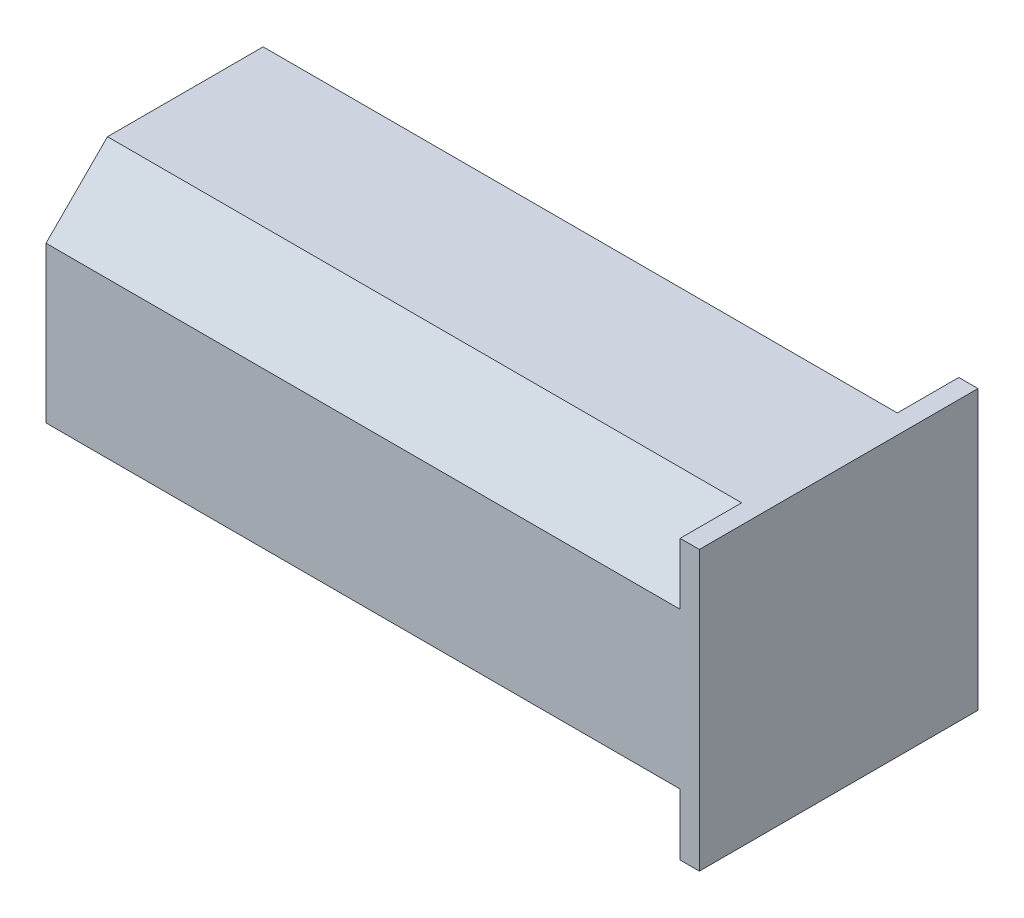
ISO-10303-21;
HEADER;
FILE_DESCRIPTION(('STEP AP214'),'2;1');
FILE_NAME('part.step','',(''),(''),'','','');
FILE_SCHEMA(('AUTOMOTIVE_DESIGN { 1 0 10303 214 1 1 1 1 }'));
ENDSEC;
DATA;
#1=APPLICATION_CONTEXT('core data for automotive mechanical design processes');
#2=APPLICATION_PROTOCOL_DEFINITION('international standard','automotive_design',2000,#1);
#3=PRODUCT_CONTEXT('',#1,'mechanical');
#4=PRODUCT('Part','Part','',(#3));
#5=PRODUCT_RELATED_PRODUCT_CATEGORY('part','',(#4));
#6=PRODUCT_DEFINITION_FORMATION('','',#4);
#7=PRODUCT_DEFINITION_CONTEXT('part definition',#1,'design');
#8=PRODUCT_DEFINITION('design','',#6,#7);
#9=PRODUCT_DEFINITION_SHAPE('','',#8);
#10=(LENGTH_UNIT() NAMED_UNIT(*) SI_UNIT(.MILLI.,.METRE.));
#11=(NAMED_UNIT(*) PLANE_ANGLE_UNIT() SI_UNIT($,.RADIAN.));
#12=(NAMED_UNIT(*) SI_UNIT($,.STERADIAN.) SOLID_ANGLE_UNIT());
#13=UNCERTAINTY_MEASURE_WITH_UNIT(LENGTH_MEASURE(1.E-05),#10,'distance_accuracy_value','');
#14=(GEOMETRIC_REPRESENTATION_CONTEXT(3) GLOBAL_UNCERTAINTY_ASSIGNED_CONTEXT((#13)) GLOBAL_UNIT_ASSIGNED_CONTEXT((#10,
#11,#12)) REPRESENTATION_CONTEXT('',''));
#15=CARTESIAN_POINT('',(0.,0.,0.));
#16=DIRECTION('',(0.,0.,1.));
#17=DIRECTION('',(1.,0.,0.));
#18=AXIS2_PLACEMENT_3D('',#15,#16,#17);
#19=CARTESIAN_POINT('',(95.500000000003,-2.9951961753816E-12,1356.24860364586));
#20=DIRECTION('',(0.,0.,1.));
#21=DIRECTION('',(1.,0.,0.));
#22=AXIS2_PLACEMENT_3D('',#19,#20,#21);
#23=PLANE('',#22);
#24=DIRECTION('',(1.,0.,0.));
#25=VECTOR('',#24,1.);
#26=CARTESIAN_POINT('',(103.500000000003,-36.250000000003,1356.24860364586));
#27=LINE('',#26,#25);
#28=CARTESIAN_POINT('',(95.500000000003,-36.250000000003,1356.24860364586));
#29=VERTEX_POINT('',#28);
#30=CARTESIAN_POINT('',(100.500000000003,-36.250000000003,1356.24860364586));
#31=VERTEX_POINT('',#30);
#32=EDGE_CURVE('E111',#29,#31,#27,.T.);
#33=ORIENTED_EDGE('',*,*,#32,.T.);
#34=DIRECTION('',(0.,1.,0.));
#35=VECTOR('',#34,1.);
#36=CARTESIAN_POINT('',(100.500000000003,-2.9951961753816E-12,1356.24860364586));
#37=LINE('',#36,#35);
#38=CARTESIAN_POINT('',(100.500000000003,36.249999999997,1356.24860364586));
#39=VERTEX_POINT('',#38);
#40=EDGE_CURVE('E102',#31,#39,#37,.T.);
#41=ORIENTED_EDGE('',*,*,#40,.T.);
#42=DIRECTION('',(1.,0.,0.));
#43=VECTOR('',#42,1.);
#44=CARTESIAN_POINT('',(103.500000000003,36.249999999997,1356.24860364586));
#45=LINE('',#44,#43);
#46=CARTESIAN_POINT('',(95.500000000003,36.249999999997,1356.24860364586));
#47=VERTEX_POINT('',#46);
#48=EDGE_CURVE('E20',#47,#39,#45,.T.);
#49=ORIENTED_EDGE('',*,*,#48,.F.);
#50=DIRECTION('',(0.,-1.,0.));
#51=VECTOR('',#50,1.);
#52=CARTESIAN_POINT('',(95.500000000003,36.249999999997,1356.24860364586));
#53=LINE('',#52,#51);
#54=CARTESIAN_POINT('',(95.500000000003,20.249999999997,1356.24860364586));
#55=VERTEX_POINT('',#54);
#56=EDGE_CURVE('E110',#47,#55,#53,.T.);
#57=ORIENTED_EDGE('',*,*,#56,.T.);
#58=DIRECTION('',(-1.,0.,0.));
#59=VECTOR('',#58,1.);
#60=CARTESIAN_POINT('',(95.500000000003,20.249999999997,1356.24860364586));
#61=LINE('',#60,#59);
#62=CARTESIAN_POINT('',(-69.499999999997,20.249999999997,1356.24860364586));
#63=VERTEX_POINT('',#62);
#64=EDGE_CURVE('E171',#55,#63,#61,.T.);
#65=ORIENTED_EDGE('',*,*,#64,.T.);
#66=DIRECTION('',(0.,-1.,0.));
#67=VECTOR('',#66,1.);
#68=CARTESIAN_POINT('',(-69.499999999997,-2.97499017054353E-12,1356.24860364586));
#69=LINE('',#68,#67);
#70=CARTESIAN_POINT('',(-69.499999999997,-20.2500000000029,1356.24860364586));
#71=VERTEX_POINT('',#70);
#72=EDGE_CURVE('E168',#63,#71,#69,.T.);
#73=ORIENTED_EDGE('',*,*,#72,.T.);
#74=DIRECTION('',(1.,0.,0.));
#75=VECTOR('',#74,1.);
#76=CARTESIAN_POINT('',(95.500000000003,-20.250000000003,1356.24860364586));
#77=LINE('',#76,#75);
#78=CARTESIAN_POINT('',(95.500000000003,-20.2500000000029,1356.24860364586));
#79=VERTEX_POINT('',#78);
#80=EDGE_CURVE('E170',#71,#79,#77,.T.);
#81=ORIENTED_EDGE('',*,*,#80,.T.);
#82=EDGE_CURVE('E115',#79,#29,#53,.T.);
#83=ORIENTED_EDGE('',*,*,#82,.T.);
#84=EDGE_LOOP('',(#33,#41,#49,#57,#65,#73,#81,#83));
#85=FACE_BOUND('',#84,.T.);
#86=ADVANCED_FACE('F16',(#85),#23,.T.);
#87=CARTESIAN_POINT('',(95.500000000003,-36.250000000003,1319.99860364586));
#88=DIRECTION('',(0.,-1.,0.));
#89=DIRECTION('',(-1.,0.,0.));
#90=AXIS2_PLACEMENT_3D('',#87,#88,#89);
#91=PLANE('',#90);
#92=DIRECTION('',(1.,0.,0.));
#93=VECTOR('',#92,1.);
#94=CARTESIAN_POINT('',(103.500000000003,-36.250000000003,1283.74860364586));
#95=LINE('',#94,#93);
#96=CARTESIAN_POINT('',(95.500000000003,-36.250000000003,1283.74860364586));
#97=VERTEX_POINT('',#96);
#98=CARTESIAN_POINT('',(100.500000000003,-36.250000000003,1283.74860364586));
#99=VERTEX_POINT('',#98);
#100=EDGE_CURVE('E122',#97,#99,#95,.T.);
#101=ORIENTED_EDGE('',*,*,#100,.T.);
#102=DIRECTION('',(0.,0.,1.));
#103=VECTOR('',#102,1.);
#104=CARTESIAN_POINT('',(100.500000000003,-36.250000000003,1319.99860364586));
#105=LINE('',#104,#103);
#106=EDGE_CURVE('E105',#99,#31,#105,.T.);
#107=ORIENTED_EDGE('',*,*,#106,.T.);
#108=ORIENTED_EDGE('',*,*,#32,.F.);
#109=DIRECTION('',(0.,0.,1.));
#110=VECTOR('',#109,1.);
#111=CARTESIAN_POINT('',(95.500000000003,-36.250000000003,1283.74860364586));
#112=LINE('',#111,#110);
#113=CARTESIAN_POINT('',(95.500000000003,-36.250000000003,1340.24860364586));
#114=VERTEX_POINT('',#113);
#115=EDGE_CURVE('E198',#114,#29,#112,.T.);
#116=ORIENTED_EDGE('',*,*,#115,.F.);
#117=DIRECTION('',(-1.,0.,0.));
#118=VECTOR('',#117,1.);
#119=CARTESIAN_POINT('',(95.500000000003,-36.250000000003,1340.24860364586));
#120=LINE('',#119,#118);
#121=CARTESIAN_POINT('',(-69.499999999997,-36.2500000000029,1340.24860364586));
#122=VERTEX_POINT('',#121);
#123=EDGE_CURVE('E123',#114,#122,#120,.T.);
#124=ORIENTED_EDGE('',*,*,#123,.T.);
#125=DIRECTION('',(0.,0.,-1.));
#126=VECTOR('',#125,1.);
#127=CARTESIAN_POINT('',(-69.499999999997,-36.250000000003,1319.99860364586));
#128=LINE('',#127,#126);
#129=CARTESIAN_POINT('',(-69.499999999997,-36.250000000003,1299.74860364586));
#130=VERTEX_POINT('',#129);
#131=EDGE_CURVE('E126',#122,#130,#128,.T.);
#132=ORIENTED_EDGE('',*,*,#131,.T.);
#133=DIRECTION('',(1.,0.,0.));
#134=VECTOR('',#133,1.);
#135=CARTESIAN_POINT('',(95.500000000003,-36.250000000003,1299.74860364586));
#136=LINE('',#135,#134);
#137=CARTESIAN_POINT('',(95.500000000003,-36.250000000003,1299.74860364586));
#138=VERTEX_POINT('',#137);
#139=EDGE_CURVE('E134',#130,#138,#136,.T.);
#140=ORIENTED_EDGE('',*,*,#139,.T.);
#141=EDGE_CURVE('E150',#97,#138,#112,.T.);
#142=ORIENTED_EDGE('',*,*,#141,.F.);
#143=EDGE_LOOP('',(#101,#107,#108,#116,#124,#132,#140,#142));
#144=FACE_BOUND('',#143,.T.);
#145=ADVANCED_FACE('F119',(#144),#91,.T.);
#146=CARTESIAN_POINT('',(95.500000000003,-2.99075697734899E-12,1283.74860364586));
#147=DIRECTION('',(0.,0.,-1.));
#148=DIRECTION('',(-1.,0.,0.));
#149=AXIS2_PLACEMENT_3D('',#146,#147,#148);
#150=PLANE('',#149);
#151=DIRECTION('',(1.,0.,0.));
#152=VECTOR('',#151,1.);
#153=CARTESIAN_POINT('',(103.500000000003,36.249999999997,1283.74860364586));
#154=LINE('',#153,#152);
#155=CARTESIAN_POINT('',(95.500000000003,36.249999999997,1283.74860364586));
#156=VERTEX_POINT('',#155);
#157=CARTESIAN_POINT('',(100.500000000003,36.249999999997,1283.74860364586));
#158=VERTEX_POINT('',#157);
#159=EDGE_CURVE('E133',#156,#158,#154,.T.);
#160=ORIENTED_EDGE('',*,*,#159,.T.);
#161=DIRECTION('',(0.,-1.,0.));
#162=VECTOR('',#161,1.);
#163=CARTESIAN_POINT('',(100.500000000003,-2.99075697734899E-12,1283.74860364586));
#164=LINE('',#163,#162);
#165=EDGE_CURVE('E39',#158,#99,#164,.T.);
#166=ORIENTED_EDGE('',*,*,#165,.T.);
#167=ORIENTED_EDGE('',*,*,#100,.F.);
#168=DIRECTION('',(0.,-1.,0.));
#169=VECTOR('',#168,1.);
#170=CARTESIAN_POINT('',(95.500000000003,36.249999999997,1283.74860364586));
#171=LINE('',#170,#169);
#172=CARTESIAN_POINT('',(95.500000000003,-20.2500000000029,1283.74860364586));
#173=VERTEX_POINT('',#172);
#174=EDGE_CURVE('E11',#173,#97,#171,.T.);
#175=ORIENTED_EDGE('',*,*,#174,.F.);
#176=DIRECTION('',(-1.,0.,0.));
#177=VECTOR('',#176,1.);
#178=CARTESIAN_POINT('',(95.500000000003,-20.250000000003,1283.74860364586));
#179=LINE('',#178,#177);
#180=CARTESIAN_POINT('',(-69.499999999997,-20.2500000000029,1283.74860364586));
#181=VERTEX_POINT('',#180);
#182=EDGE_CURVE('E132',#173,#181,#179,.T.);
#183=ORIENTED_EDGE('',*,*,#182,.T.);
#184=DIRECTION('',(0.,1.,0.));
#185=VECTOR('',#184,1.);
#186=CARTESIAN_POINT('',(-69.499999999997,-2.97055097251093E-12,1283.74860364586));
#187=LINE('',#186,#185);
#188=CARTESIAN_POINT('',(-69.499999999997,20.249999999997,1283.74860364586));
#189=VERTEX_POINT('',#188);
#190=EDGE_CURVE('E173',#181,#189,#187,.T.);
#191=ORIENTED_EDGE('',*,*,#190,.T.);
#192=DIRECTION('',(1.,0.,0.));
#193=VECTOR('',#192,1.);
#194=CARTESIAN_POINT('',(95.500000000003,20.249999999997,1283.74860364586));
#195=LINE('',#194,#193);
#196=CARTESIAN_POINT('',(95.500000000003,20.249999999997,1283.74860364586));
#197=VERTEX_POINT('',#196);
#198=EDGE_CURVE('E176',#189,#197,#195,.T.);
#199=ORIENTED_EDGE('',*,*,#198,.T.);
#200=EDGE_CURVE('E164',#156,#197,#171,.T.);
#201=ORIENTED_EDGE('',*,*,#200,.F.);
#202=EDGE_LOOP('',(#160,#166,#167,#175,#183,#191,#199,#201));
#203=FACE_BOUND('',#202,.T.);
#204=ADVANCED_FACE('F250',(#203),#150,.T.);
#205=CARTESIAN_POINT('',(95.500000000003,36.249999999997,1319.99860364586));
#206=DIRECTION('',(0.,1.,0.));
#207=DIRECTION('',(1.,0.,0.));
#208=AXIS2_PLACEMENT_3D('',#205,#206,#207);
#209=PLANE('',#208);
#210=ORIENTED_EDGE('',*,*,#48,.T.);
#211=DIRECTION('',(0.,0.,-1.));
#212=VECTOR('',#211,1.);
#213=CARTESIAN_POINT('',(100.500000000003,36.249999999997,1319.99860364586));
#214=LINE('',#213,#212);
#215=EDGE_CURVE('E33',#39,#158,#214,.T.);
#216=ORIENTED_EDGE('',*,*,#215,.T.);
#217=ORIENTED_EDGE('',*,*,#159,.F.);
#218=DIRECTION('',(0.,0.,1.));
#219=VECTOR('',#218,1.);
#220=CARTESIAN_POINT('',(95.500000000003,36.249999999997,1283.74860364586));
#221=LINE('',#220,#219);
#222=CARTESIAN_POINT('',(95.500000000003,36.249999999997,1299.74860364586));
#223=VERTEX_POINT('',#222);
#224=EDGE_CURVE('E184',#156,#223,#221,.T.);
#225=ORIENTED_EDGE('',*,*,#224,.T.);
#226=DIRECTION('',(-1.,0.,0.));
#227=VECTOR('',#226,1.);
#228=CARTESIAN_POINT('',(95.500000000003,36.249999999997,1299.74860364586));
#229=LINE('',#228,#227);
#230=CARTESIAN_POINT('',(-69.499999999997,36.249999999997,1299.74860364586));
#231=VERTEX_POINT('',#230);
#232=EDGE_CURVE('E181',#223,#231,#229,.T.);
#233=ORIENTED_EDGE('',*,*,#232,.T.);
#234=DIRECTION('',(0.,0.,1.));
#235=VECTOR('',#234,1.);
#236=CARTESIAN_POINT('',(-69.499999999997,36.249999999997,1319.99860364586));
#237=LINE('',#236,#235);
#238=CARTESIAN_POINT('',(-69.499999999997,36.249999999997,1340.24860364586));
#239=VERTEX_POINT('',#238);
#240=EDGE_CURVE('E177',#231,#239,#237,.T.);
#241=ORIENTED_EDGE('',*,*,#240,.T.);
#242=DIRECTION('',(1.,0.,0.));
#243=VECTOR('',#242,1.);
#244=CARTESIAN_POINT('',(95.500000000003,36.249999999997,1340.24860364586));
#245=LINE('',#244,#243);
#246=CARTESIAN_POINT('',(95.500000000003,36.249999999997,1340.24860364586));
#247=VERTEX_POINT('',#246);
#248=EDGE_CURVE('E180',#239,#247,#245,.T.);
#249=ORIENTED_EDGE('',*,*,#248,.T.);
#250=EDGE_CURVE('E161',#247,#47,#221,.T.);
#251=ORIENTED_EDGE('',*,*,#250,.T.);
#252=EDGE_LOOP('',(#210,#216,#217,#225,#233,#241,#249,#251));
#253=FACE_BOUND('',#252,.T.);
#254=ADVANCED_FACE('F273',(#253),#209,.T.);
#255=CARTESIAN_POINT('',(-69.499999999997,-2.97277057152723E-12,1319.99860364586));
#256=DIRECTION('',(-1.,0.,0.));
#257=DIRECTION('',(0.,1.,0.));
#258=AXIS2_PLACEMENT_3D('',#255,#256,#257);
#259=PLANE('',#258);
#260=ORIENTED_EDGE('',*,*,#240,.F.);
#261=DIRECTION('',(0.,0.707106781186547,0.707106781186548));
#262=VECTOR('',#261,1.);
#263=CARTESIAN_POINT('',(-69.499999999997,28.249999999997,1291.74860364586));
#264=LINE('',#263,#262);
#265=EDGE_CURVE('E158',#231,#189,#264,.F.);
#266=ORIENTED_EDGE('',*,*,#265,.T.);
#267=ORIENTED_EDGE('',*,*,#190,.F.);
#268=DIRECTION('',(0.,0.707106781186547,-0.707106781186548));
#269=VECTOR('',#268,1.);
#270=CARTESIAN_POINT('',(-69.499999999997,-28.2500000000029,1291.74860364586));
#271=LINE('',#270,#269);
#272=EDGE_CURVE('E160',#181,#130,#271,.F.);
#273=ORIENTED_EDGE('',*,*,#272,.T.);
#274=ORIENTED_EDGE('',*,*,#131,.F.);
#275=DIRECTION('',(0.,-0.707106781186547,-0.707106781186548));
#276=VECTOR('',#275,1.);
#277=CARTESIAN_POINT('',(-69.499999999997,-28.2500000000029,1348.24860364586));
#278=LINE('',#277,#276);
#279=EDGE_CURVE('E165',#122,#71,#278,.F.);
#280=ORIENTED_EDGE('',*,*,#279,.T.);
#281=ORIENTED_EDGE('',*,*,#72,.F.);
#282=DIRECTION('',(0.,-0.707106781186547,0.707106781186548));
#283=VECTOR('',#282,1.);
#284=CARTESIAN_POINT('',(-69.499999999997,28.249999999997,1348.24860364586));
#285=LINE('',#284,#283);
#286=EDGE_CURVE('E162',#63,#239,#285,.F.);
#287=ORIENTED_EDGE('',*,*,#286,.T.);
#288=EDGE_LOOP('',(#260,#266,#267,#273,#274,#280,#281,#287));
#289=FACE_BOUND('',#288,.T.);
#290=ADVANCED_FACE('F243',(#289),#259,.T.);
#291=CARTESIAN_POINT('',(95.500000000003,36.249999999997,1299.74860364586));
#292=DIRECTION('',(0.,-0.707106781186548,0.707106781186547));
#293=DIRECTION('',(0.,-0.707106781186547,-0.707106781186548));
#294=AXIS2_PLACEMENT_3D('',#291,#292,#293);
#295=PLANE('',#294);
#296=DIRECTION('',(0.,-0.707106781186547,-0.707106781186548));
#297=VECTOR('',#296,1.);
#298=CARTESIAN_POINT('',(95.500000000003,28.249999999997,1291.74860364586));
#299=LINE('',#298,#297);
#300=EDGE_CURVE('E216',#197,#223,#299,.F.);
#301=ORIENTED_EDGE('',*,*,#300,.F.);
#302=ORIENTED_EDGE('',*,*,#198,.F.);
#303=ORIENTED_EDGE('',*,*,#265,.F.);
#304=ORIENTED_EDGE('',*,*,#232,.F.);
#305=EDGE_LOOP('',(#301,#302,#303,#304));
#306=FACE_BOUND('',#305,.T.);
#307=ADVANCED_FACE('F278',(#306),#295,.F.);
#308=CARTESIAN_POINT('',(95.500000000003,20.249999999997,1356.24860364586));
#309=DIRECTION('',(0.,-0.707106781186548,-0.707106781186547));
#310=DIRECTION('',(0.,0.707106781186547,-0.707106781186548));
#311=AXIS2_PLACEMENT_3D('',#308,#309,#310);
#312=PLANE('',#311);
#313=DIRECTION('',(0.,0.707106781186547,-0.707106781186548));
#314=VECTOR('',#313,1.);
#315=CARTESIAN_POINT('',(95.500000000003,28.249999999997,1348.24860364586));
#316=LINE('',#315,#314);
#317=EDGE_CURVE('E220',#247,#55,#316,.F.);
#318=ORIENTED_EDGE('',*,*,#317,.F.);
#319=ORIENTED_EDGE('',*,*,#248,.F.);
#320=ORIENTED_EDGE('',*,*,#286,.F.);
#321=ORIENTED_EDGE('',*,*,#64,.F.);
#322=EDGE_LOOP('',(#318,#319,#320,#321));
#323=FACE_BOUND('',#322,.T.);
#324=ADVANCED_FACE('F283',(#323),#312,.F.);
#325=CARTESIAN_POINT('',(95.500000000003,-36.250000000003,1340.24860364586));
#326=DIRECTION('',(0.,0.707106781186548,-0.707106781186547));
#327=DIRECTION('',(0.,0.707106781186547,0.707106781186548));
#328=AXIS2_PLACEMENT_3D('',#325,#326,#327);
#329=PLANE('',#328);
#330=DIRECTION('',(0.,0.707106781186547,0.707106781186548));
#331=VECTOR('',#330,1.);
#332=CARTESIAN_POINT('',(95.500000000003,-28.2500000000029,1348.24860364586));
#333=LINE('',#332,#331);
#334=EDGE_CURVE('E200',#79,#114,#333,.F.);
#335=ORIENTED_EDGE('',*,*,#334,.F.);
#336=ORIENTED_EDGE('',*,*,#80,.F.);
#337=ORIENTED_EDGE('',*,*,#279,.F.);
#338=ORIENTED_EDGE('',*,*,#123,.F.);
#339=EDGE_LOOP('',(#335,#336,#337,#338));
#340=FACE_BOUND('',#339,.T.);
#341=ADVANCED_FACE('F289',(#340),#329,.F.);
#342=CARTESIAN_POINT('',(95.500000000003,-20.250000000003,1283.74860364586));
#343=DIRECTION('',(0.,0.707106781186548,0.707106781186547));
#344=DIRECTION('',(0.,-0.707106781186547,0.707106781186548));
#345=AXIS2_PLACEMENT_3D('',#342,#343,#344);
#346=PLANE('',#345);
#347=DIRECTION('',(0.,-0.707106781186547,0.707106781186548));
#348=VECTOR('',#347,1.);
#349=CARTESIAN_POINT('',(95.500000000003,-28.2500000000029,1291.74860364586));
#350=LINE('',#349,#348);
#351=EDGE_CURVE('E25',#138,#173,#350,.F.);
#352=ORIENTED_EDGE('',*,*,#351,.F.);
#353=ORIENTED_EDGE('',*,*,#139,.F.);
#354=ORIENTED_EDGE('',*,*,#272,.F.);
#355=ORIENTED_EDGE('',*,*,#182,.F.);
#356=EDGE_LOOP('',(#352,#353,#354,#355));
#357=FACE_BOUND('',#356,.T.);
#358=ADVANCED_FACE('F248',(#357),#346,.F.);
#359=CARTESIAN_POINT('',(95.500000000003,36.249999999997,1356.24860364586));
#360=DIRECTION('',(-1.,0.,0.));
#361=DIRECTION('',(0.,-1.,0.));
#362=AXIS2_PLACEMENT_3D('',#359,#360,#361);
#363=PLANE('',#362);
#364=ORIENTED_EDGE('',*,*,#200,.T.);
#365=ORIENTED_EDGE('',*,*,#300,.T.);
#366=ORIENTED_EDGE('',*,*,#224,.F.);
#367=EDGE_LOOP('',(#364,#365,#366));
#368=FACE_BOUND('',#367,.T.);
#369=ADVANCED_FACE('F255',(#368),#363,.T.);
#370=ORIENTED_EDGE('',*,*,#250,.F.);
#371=ORIENTED_EDGE('',*,*,#317,.T.);
#372=ORIENTED_EDGE('',*,*,#56,.F.);
#373=EDGE_LOOP('',(#370,#371,#372));
#374=FACE_BOUND('',#373,.T.);
#375=ADVANCED_FACE('F261',(#374),#363,.T.);
#376=ORIENTED_EDGE('',*,*,#82,.F.);
#377=ORIENTED_EDGE('',*,*,#334,.T.);
#378=ORIENTED_EDGE('',*,*,#115,.T.);
#379=EDGE_LOOP('',(#376,#377,#378));
#380=FACE_BOUND('',#379,.T.);
#381=ADVANCED_FACE('F237',(#380),#363,.T.);
#382=ORIENTED_EDGE('',*,*,#141,.T.);
#383=ORIENTED_EDGE('',*,*,#351,.T.);
#384=ORIENTED_EDGE('',*,*,#174,.T.);
#385=EDGE_LOOP('',(#382,#383,#384));
#386=FACE_BOUND('',#385,.T.);
#387=ADVANCED_FACE('F252',(#386),#363,.T.);
#388=CARTESIAN_POINT('',(100.500000000003,-3.00167567668028E-12,1319.99860364586));
#389=DIRECTION('',(1.,0.,0.));
#390=DIRECTION('',(0.,0.,-1.));
#391=AXIS2_PLACEMENT_3D('',#388,#389,#390);
#392=PLANE('',#391);
#393=ORIENTED_EDGE('',*,*,#40,.F.);
#394=ORIENTED_EDGE('',*,*,#106,.F.);
#395=ORIENTED_EDGE('',*,*,#165,.F.);
#396=ORIENTED_EDGE('',*,*,#215,.F.);
#397=EDGE_LOOP('',(#393,#394,#395,#396));
#398=FACE_BOUND('',#397,.T.);
#399=ADVANCED_FACE('F18',(#398),#392,.T.);
#400=CLOSED_SHELL('',(#86,#145,#204,#254,#290,#307,#324,#341,#358,#369,#375,#381,#387,#399));
#401=MANIFOLD_SOLID_BREP('B1',#400);
#402=ADVANCED_BREP_SHAPE_REPRESENTATION('',(#18,#401),#14);
#403=SHAPE_DEFINITION_REPRESENTATION(#9,#402);
ENDSEC;
END-ISO-10303-21;
